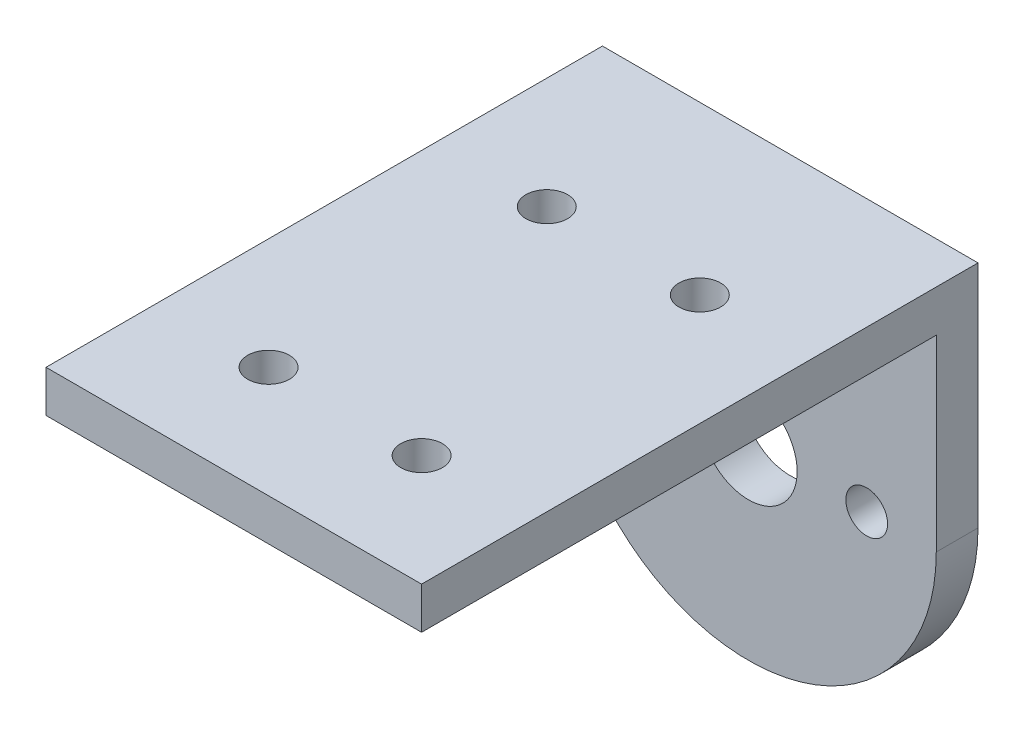
ISO-10303-21;
HEADER;
FILE_DESCRIPTION(('STEP AP214'),'2;1');
FILE_NAME('part.step','',(''),(''),'','','');
FILE_SCHEMA(('AUTOMOTIVE_DESIGN { 1 0 10303 214 1 1 1 1 }'));
ENDSEC;
DATA;
#1=APPLICATION_CONTEXT('core data for automotive mechanical design processes');
#2=APPLICATION_PROTOCOL_DEFINITION('international standard','automotive_design',2000,#1);
#3=PRODUCT_CONTEXT('',#1,'mechanical');
#4=PRODUCT('Part','Part','',(#3));
#5=PRODUCT_RELATED_PRODUCT_CATEGORY('part','',(#4));
#6=PRODUCT_DEFINITION_FORMATION('','',#4);
#7=PRODUCT_DEFINITION_CONTEXT('part definition',#1,'design');
#8=PRODUCT_DEFINITION('design','',#6,#7);
#9=PRODUCT_DEFINITION_SHAPE('','',#8);
#10=(LENGTH_UNIT() NAMED_UNIT(*) SI_UNIT(.MILLI.,.METRE.));
#11=(NAMED_UNIT(*) PLANE_ANGLE_UNIT() SI_UNIT($,.RADIAN.));
#12=(NAMED_UNIT(*) SI_UNIT($,.STERADIAN.) SOLID_ANGLE_UNIT());
#13=UNCERTAINTY_MEASURE_WITH_UNIT(LENGTH_MEASURE(1.E-05),#10,'distance_accuracy_value','');
#14=(GEOMETRIC_REPRESENTATION_CONTEXT(3) GLOBAL_UNCERTAINTY_ASSIGNED_CONTEXT((#13)) GLOBAL_UNIT_ASSIGNED_CONTEXT((#10,
#11,#12)) REPRESENTATION_CONTEXT('',''));
#15=CARTESIAN_POINT('',(0.,0.,0.));
#16=DIRECTION('',(0.,0.,1.));
#17=DIRECTION('',(1.,0.,0.));
#18=AXIS2_PLACEMENT_3D('',#15,#16,#17);
#19=CARTESIAN_POINT('',(2606.26671450499,1592.8264256332,40.));
#20=DIRECTION('',(0.,0.,1.));
#21=DIRECTION('',(1.,0.,0.));
#22=AXIS2_PLACEMENT_3D('',#19,#20,#21);
#23=PLANE('',#22);
#24=DIRECTION('',(1.,0.,0.));
#25=VECTOR('',#24,1.);
#26=CARTESIAN_POINT('',(2579.76671450502,1606.3264256332,40.));
#27=LINE('',#26,#25);
#28=CARTESIAN_POINT('',(2592.76671450499,1606.3264256332,40.));
#29=VERTEX_POINT('',#28);
#30=CARTESIAN_POINT('',(2619.76671450502,1606.3264256332,40.));
#31=VERTEX_POINT('',#30);
#32=EDGE_CURVE('E123',#29,#31,#27,.T.);
#33=ORIENTED_EDGE('',*,*,#32,.T.);
#34=DIRECTION('',(0.,1.,0.));
#35=VECTOR('',#34,1.);
#36=CARTESIAN_POINT('',(2619.76671450499,1592.8264256332,40.));
#37=LINE('',#36,#35);
#38=CARTESIAN_POINT('',(2619.76671450499,1609.3264256332,40.));
#39=VERTEX_POINT('',#38);
#40=EDGE_CURVE('E99',#31,#39,#37,.T.);
#41=ORIENTED_EDGE('',*,*,#40,.T.);
#42=DIRECTION('',(-1.,0.,0.));
#43=VECTOR('',#42,1.);
#44=CARTESIAN_POINT('',(2592.76671450499,1609.3264256332,40.));
#45=LINE('',#44,#43);
#46=CARTESIAN_POINT('',(2592.76671450499,1609.3264256332,40.));
#47=VERTEX_POINT('',#46);
#48=EDGE_CURVE('E59',#39,#47,#45,.T.);
#49=ORIENTED_EDGE('',*,*,#48,.T.);
#50=DIRECTION('',(0.,-1.,0.));
#51=VECTOR('',#50,1.);
#52=CARTESIAN_POINT('',(2592.76671450499,1592.8264256332,40.));
#53=LINE('',#52,#51);
#54=EDGE_CURVE('E90',#47,#29,#53,.T.);
#55=ORIENTED_EDGE('',*,*,#54,.T.);
#56=EDGE_LOOP('',(#33,#41,#49,#55));
#57=FACE_BOUND('',#56,.T.);
#58=ADVANCED_FACE('F33',(#57),#23,.T.);
#59=CARTESIAN_POINT('',(2606.26671450499,1592.8264256332,0.));
#60=DIRECTION('',(0.,0.,1.));
#61=DIRECTION('',(1.,0.,0.));
#62=AXIS2_PLACEMENT_3D('',#59,#60,#61);
#63=PLANE('',#62);
#64=CARTESIAN_POINT('',(2597.76671450499,1592.8264256332,0.));
#65=DIRECTION('',(0.,0.,-1.));
#66=DIRECTION('',(-1.,0.,0.));
#67=AXIS2_PLACEMENT_3D('',#64,#65,#66);
#68=CIRCLE('',#67,1.50000000000011);
#69=CARTESIAN_POINT('',(2596.26671450499,1592.8264256332,0.));
#70=VERTEX_POINT('',#69);
#71=EDGE_CURVE('E336',#70,#70,#68,.T.);
#72=ORIENTED_EDGE('',*,*,#71,.F.);
#73=EDGE_LOOP('',(#72));
#74=FACE_BOUND('',#73,.T.);
#75=CARTESIAN_POINT('',(2614.766714505,1592.8264256332,0.));
#76=DIRECTION('',(0.,0.,-1.));
#77=DIRECTION('',(-1.,0.,0.));
#78=AXIS2_PLACEMENT_3D('',#75,#76,#77);
#79=CIRCLE('',#78,1.49999999999962);
#80=CARTESIAN_POINT('',(2613.266714505,1592.8264256332,0.));
#81=VERTEX_POINT('',#80);
#82=EDGE_CURVE('E341',#81,#81,#79,.T.);
#83=ORIENTED_EDGE('',*,*,#82,.F.);
#84=EDGE_LOOP('',(#83));
#85=FACE_BOUND('',#84,.T.);
#86=CARTESIAN_POINT('',(2606.26671450499,1592.8264256332,0.));
#87=DIRECTION('',(0.,0.,1.));
#88=DIRECTION('',(1.,0.,0.));
#89=AXIS2_PLACEMENT_3D('',#86,#87,#88);
#90=CIRCLE('',#89,13.5000000000001);
#91=CARTESIAN_POINT('',(2592.76671450499,1592.8264256332,0.));
#92=VERTEX_POINT('',#91);
#93=CARTESIAN_POINT('',(2619.76671450499,1592.8264256332,0.));
#94=VERTEX_POINT('',#93);
#95=EDGE_CURVE('E83',#92,#94,#90,.T.);
#96=ORIENTED_EDGE('',*,*,#95,.F.);
#97=DIRECTION('',(0.,-1.,0.));
#98=VECTOR('',#97,1.);
#99=CARTESIAN_POINT('',(2592.76671450499,1592.8264256332,0.));
#100=LINE('',#99,#98);
#101=CARTESIAN_POINT('',(2592.76671450499,1609.3264256332,0.));
#102=VERTEX_POINT('',#101);
#103=EDGE_CURVE('E94',#102,#92,#100,.T.);
#104=ORIENTED_EDGE('',*,*,#103,.F.);
#105=DIRECTION('',(-1.,0.,0.));
#106=VECTOR('',#105,1.);
#107=CARTESIAN_POINT('',(2592.76671450499,1609.3264256332,0.));
#108=LINE('',#107,#106);
#109=CARTESIAN_POINT('',(2619.76671450499,1609.3264256332,0.));
#110=VERTEX_POINT('',#109);
#111=EDGE_CURVE('E100',#110,#102,#108,.T.);
#112=ORIENTED_EDGE('',*,*,#111,.F.);
#113=DIRECTION('',(0.,1.,0.));
#114=VECTOR('',#113,1.);
#115=CARTESIAN_POINT('',(2619.76671450499,1592.8264256332,0.));
#116=LINE('',#115,#114);
#117=EDGE_CURVE('E105',#94,#110,#116,.T.);
#118=ORIENTED_EDGE('',*,*,#117,.F.);
#119=EDGE_LOOP('',(#96,#104,#112,#118));
#120=FACE_BOUND('',#119,.T.);
#121=CARTESIAN_POINT('',(2606.26671450499,1592.8264256332,0.));
#122=DIRECTION('',(0.,0.,1.));
#123=DIRECTION('',(1.,0.,0.));
#124=AXIS2_PLACEMENT_3D('',#121,#122,#123);
#125=CIRCLE('',#124,3.49999999999984);
#126=CARTESIAN_POINT('',(2609.76671450499,1592.8264256332,0.));
#127=VERTEX_POINT('',#126);
#128=EDGE_CURVE('E106',#127,#127,#125,.T.);
#129=ORIENTED_EDGE('',*,*,#128,.T.);
#130=EDGE_LOOP('',(#129));
#131=FACE_BOUND('',#130,.T.);
#132=ADVANCED_FACE('F103',(#74,#85,#120,#131),#63,.F.);
#133=CARTESIAN_POINT('',(2606.26671450499,1592.8264256332,40.));
#134=DIRECTION('',(0.,0.,-1.));
#135=DIRECTION('',(-1.,0.,0.));
#136=AXIS2_PLACEMENT_3D('',#133,#134,#135);
#137=CYLINDRICAL_SURFACE('',#136,13.5000000000001);
#138=DIRECTION('',(0.,0.,-1.));
#139=VECTOR('',#138,1.);
#140=CARTESIAN_POINT('',(2619.76671450499,1592.8264256332,40.));
#141=LINE('',#140,#139);
#142=CARTESIAN_POINT('',(2619.76671450502,1592.8264256332,3.));
#143=VERTEX_POINT('',#142);
#144=EDGE_CURVE('E42',#143,#94,#141,.T.);
#145=ORIENTED_EDGE('',*,*,#144,.F.);
#146=CARTESIAN_POINT('',(2606.26671450499,1592.8264256332,3.));
#147=DIRECTION('',(0.,0.,-1.));
#148=DIRECTION('',(0.,1.,0.));
#149=AXIS2_PLACEMENT_3D('',#146,#147,#148);
#150=CIRCLE('',#149,13.5000000000001);
#151=CARTESIAN_POINT('',(2592.76671450499,1592.8264256332,3.));
#152=VERTEX_POINT('',#151);
#153=EDGE_CURVE('E86',#143,#152,#150,.T.);
#154=ORIENTED_EDGE('',*,*,#153,.T.);
#155=DIRECTION('',(0.,0.,-1.));
#156=VECTOR('',#155,1.);
#157=CARTESIAN_POINT('',(2592.76671450499,1592.8264256332,40.));
#158=LINE('',#157,#156);
#159=EDGE_CURVE('E79',#152,#92,#158,.T.);
#160=ORIENTED_EDGE('',*,*,#159,.T.);
#161=ORIENTED_EDGE('',*,*,#95,.T.);
#162=EDGE_LOOP('',(#145,#154,#160,#161));
#163=FACE_BOUND('',#162,.T.);
#164=ADVANCED_FACE('F35',(#163),#137,.T.);
#165=CARTESIAN_POINT('',(2619.76671450499,1592.8264256332,40.));
#166=DIRECTION('',(-1.,0.,0.));
#167=DIRECTION('',(0.,0.,1.));
#168=AXIS2_PLACEMENT_3D('',#165,#166,#167);
#169=PLANE('',#168);
#170=ORIENTED_EDGE('',*,*,#40,.F.);
#171=DIRECTION('',(0.,0.,1.));
#172=VECTOR('',#171,1.);
#173=CARTESIAN_POINT('',(2619.76671450502,1606.3264256332,40.));
#174=LINE('',#173,#172);
#175=CARTESIAN_POINT('',(2619.76671450502,1606.3264256332,3.));
#176=VERTEX_POINT('',#175);
#177=EDGE_CURVE('E152',#176,#31,#174,.T.);
#178=ORIENTED_EDGE('',*,*,#177,.F.);
#179=DIRECTION('',(0.,1.,0.));
#180=VECTOR('',#179,1.);
#181=CARTESIAN_POINT('',(2619.76671450502,1606.3264256332,3.));
#182=LINE('',#181,#180);
#183=EDGE_CURVE('E128',#143,#176,#182,.T.);
#184=ORIENTED_EDGE('',*,*,#183,.F.);
#185=ORIENTED_EDGE('',*,*,#144,.T.);
#186=ORIENTED_EDGE('',*,*,#117,.T.);
#187=DIRECTION('',(0.,0.,-1.));
#188=VECTOR('',#187,1.);
#189=CARTESIAN_POINT('',(2619.76671450499,1609.3264256332,40.));
#190=LINE('',#189,#188);
#191=EDGE_CURVE('E116',#39,#110,#190,.T.);
#192=ORIENTED_EDGE('',*,*,#191,.F.);
#193=EDGE_LOOP('',(#170,#178,#184,#185,#186,#192));
#194=FACE_BOUND('',#193,.T.);
#195=ADVANCED_FACE('F171',(#194),#169,.F.);
#196=CARTESIAN_POINT('',(2592.76671450499,1609.3264256332,40.));
#197=DIRECTION('',(0.,-1.,0.));
#198=DIRECTION('',(0.,0.,-1.));
#199=AXIS2_PLACEMENT_3D('',#196,#197,#198);
#200=PLANE('',#199);
#201=CARTESIAN_POINT('',(2600.76671450499,1609.3264256332,12.));
#202=DIRECTION('',(0.,1.,0.));
#203=DIRECTION('',(0.,0.,1.));
#204=AXIS2_PLACEMENT_3D('',#201,#202,#203);
#205=CIRCLE('',#204,1.50000000000008);
#206=CARTESIAN_POINT('',(2600.76671450499,1609.3264256332,13.5000000000001));
#207=VERTEX_POINT('',#206);
#208=EDGE_CURVE('E145',#207,#207,#205,.T.);
#209=ORIENTED_EDGE('',*,*,#208,.F.);
#210=EDGE_LOOP('',(#209));
#211=FACE_BOUND('',#210,.T.);
#212=CARTESIAN_POINT('',(2611.76671450499,1609.3264256332,12.));
#213=DIRECTION('',(0.,1.,0.));
#214=DIRECTION('',(0.,0.,1.));
#215=AXIS2_PLACEMENT_3D('',#212,#213,#214);
#216=CIRCLE('',#215,1.50000000000008);
#217=CARTESIAN_POINT('',(2611.76671450499,1609.3264256332,13.5000000000001));
#218=VERTEX_POINT('',#217);
#219=EDGE_CURVE('E135',#218,#218,#216,.T.);
#220=ORIENTED_EDGE('',*,*,#219,.F.);
#221=EDGE_LOOP('',(#220));
#222=FACE_BOUND('',#221,.T.);
#223=CARTESIAN_POINT('',(2611.76671450499,1609.3264256332,32.));
#224=DIRECTION('',(0.,1.,0.));
#225=DIRECTION('',(0.,0.,1.));
#226=AXIS2_PLACEMENT_3D('',#223,#224,#225);
#227=CIRCLE('',#226,1.50000000000008);
#228=CARTESIAN_POINT('',(2611.76671450499,1609.3264256332,33.5000000000001));
#229=VERTEX_POINT('',#228);
#230=EDGE_CURVE('E132',#229,#229,#227,.T.);
#231=ORIENTED_EDGE('',*,*,#230,.F.);
#232=EDGE_LOOP('',(#231));
#233=FACE_BOUND('',#232,.T.);
#234=CARTESIAN_POINT('',(2600.76671450499,1609.3264256332,32.));
#235=DIRECTION('',(0.,1.,0.));
#236=DIRECTION('',(0.,0.,1.));
#237=AXIS2_PLACEMENT_3D('',#234,#235,#236);
#238=CIRCLE('',#237,1.50000000000008);
#239=CARTESIAN_POINT('',(2600.76671450499,1609.3264256332,33.5000000000001));
#240=VERTEX_POINT('',#239);
#241=EDGE_CURVE('E129',#240,#240,#238,.T.);
#242=ORIENTED_EDGE('',*,*,#241,.F.);
#243=EDGE_LOOP('',(#242));
#244=FACE_BOUND('',#243,.T.);
#245=ORIENTED_EDGE('',*,*,#111,.T.);
#246=DIRECTION('',(0.,0.,-1.));
#247=VECTOR('',#246,1.);
#248=CARTESIAN_POINT('',(2592.76671450499,1609.3264256332,40.));
#249=LINE('',#248,#247);
#250=EDGE_CURVE('E89',#47,#102,#249,.T.);
#251=ORIENTED_EDGE('',*,*,#250,.F.);
#252=ORIENTED_EDGE('',*,*,#48,.F.);
#253=ORIENTED_EDGE('',*,*,#191,.T.);
#254=EDGE_LOOP('',(#245,#251,#252,#253));
#255=FACE_BOUND('',#254,.T.);
#256=ADVANCED_FACE('F204',(#211,#222,#233,#244,#255),#200,.F.);
#257=CARTESIAN_POINT('',(2592.76671450499,1592.8264256332,40.));
#258=DIRECTION('',(1.,0.,0.));
#259=DIRECTION('',(0.,0.,-1.));
#260=AXIS2_PLACEMENT_3D('',#257,#258,#259);
#261=PLANE('',#260);
#262=DIRECTION('',(0.,1.,0.));
#263=VECTOR('',#262,1.);
#264=CARTESIAN_POINT('',(2592.76671450499,1592.8264256332,3.));
#265=LINE('',#264,#263);
#266=CARTESIAN_POINT('',(2592.76671450499,1606.3264256332,3.));
#267=VERTEX_POINT('',#266);
#268=EDGE_CURVE('E122',#152,#267,#265,.T.);
#269=ORIENTED_EDGE('',*,*,#268,.T.);
#270=DIRECTION('',(0.,0.,1.));
#271=VECTOR('',#270,1.);
#272=CARTESIAN_POINT('',(2592.76671450499,1606.3264256332,40.));
#273=LINE('',#272,#271);
#274=EDGE_CURVE('E11',#267,#29,#273,.T.);
#275=ORIENTED_EDGE('',*,*,#274,.T.);
#276=ORIENTED_EDGE('',*,*,#54,.F.);
#277=ORIENTED_EDGE('',*,*,#250,.T.);
#278=ORIENTED_EDGE('',*,*,#103,.T.);
#279=ORIENTED_EDGE('',*,*,#159,.F.);
#280=EDGE_LOOP('',(#269,#275,#276,#277,#278,#279));
#281=FACE_BOUND('',#280,.T.);
#282=ADVANCED_FACE('F95',(#281),#261,.F.);
#283=CARTESIAN_POINT('',(2606.26671450499,1592.8264256332,40.));
#284=DIRECTION('',(0.,0.,-1.));
#285=DIRECTION('',(-1.,0.,0.));
#286=AXIS2_PLACEMENT_3D('',#283,#284,#285);
#287=CYLINDRICAL_SURFACE('',#286,3.49999999999984);
#288=CARTESIAN_POINT('',(2606.26671450499,1592.8264256332,3.));
#289=DIRECTION('',(0.,0.,-1.));
#290=DIRECTION('',(0.,1.,0.));
#291=AXIS2_PLACEMENT_3D('',#288,#289,#290);
#292=CIRCLE('',#291,3.49999999999984);
#293=CARTESIAN_POINT('',(2606.26671450499,1596.3264256332,3.));
#294=VERTEX_POINT('',#293);
#295=EDGE_CURVE('E120',#294,#294,#292,.T.);
#296=ORIENTED_EDGE('',*,*,#295,.F.);
#297=EDGE_LOOP('',(#296));
#298=FACE_BOUND('',#297,.T.);
#299=ORIENTED_EDGE('',*,*,#128,.F.);
#300=EDGE_LOOP('',(#299));
#301=FACE_BOUND('',#300,.T.);
#302=ADVANCED_FACE('F188',(#298,#301),#287,.F.);
#303=CARTESIAN_POINT('',(2579.76671450502,1606.3264256332,40.));
#304=DIRECTION('',(0.,1.,0.));
#305=DIRECTION('',(-1.,0.,0.));
#306=AXIS2_PLACEMENT_3D('',#303,#304,#305);
#307=PLANE('',#306);
#308=CARTESIAN_POINT('',(2600.76671450499,1606.3264256332,12.));
#309=DIRECTION('',(0.,1.,0.));
#310=DIRECTION('',(-1.,0.,0.));
#311=AXIS2_PLACEMENT_3D('',#308,#309,#310);
#312=CIRCLE('',#311,1.50000000000008);
#313=CARTESIAN_POINT('',(2599.26671450499,1606.3264256332,12.));
#314=VERTEX_POINT('',#313);
#315=EDGE_CURVE('E37',#314,#314,#312,.T.);
#316=ORIENTED_EDGE('',*,*,#315,.T.);
#317=EDGE_LOOP('',(#316));
#318=FACE_BOUND('',#317,.T.);
#319=CARTESIAN_POINT('',(2611.76671450499,1606.3264256332,12.));
#320=DIRECTION('',(0.,1.,0.));
#321=DIRECTION('',(-1.,0.,0.));
#322=AXIS2_PLACEMENT_3D('',#319,#320,#321);
#323=CIRCLE('',#322,1.50000000000008);
#324=CARTESIAN_POINT('',(2610.26671450499,1606.3264256332,12.));
#325=VERTEX_POINT('',#324);
#326=EDGE_CURVE('E133',#325,#325,#323,.T.);
#327=ORIENTED_EDGE('',*,*,#326,.T.);
#328=EDGE_LOOP('',(#327));
#329=FACE_BOUND('',#328,.T.);
#330=CARTESIAN_POINT('',(2611.76671450499,1606.3264256332,32.));
#331=DIRECTION('',(0.,1.,0.));
#332=DIRECTION('',(-1.,0.,0.));
#333=AXIS2_PLACEMENT_3D('',#330,#331,#332);
#334=CIRCLE('',#333,1.50000000000008);
#335=CARTESIAN_POINT('',(2610.26671450499,1606.3264256332,32.));
#336=VERTEX_POINT('',#335);
#337=EDGE_CURVE('E130',#336,#336,#334,.T.);
#338=ORIENTED_EDGE('',*,*,#337,.T.);
#339=EDGE_LOOP('',(#338));
#340=FACE_BOUND('',#339,.T.);
#341=CARTESIAN_POINT('',(2600.76671450499,1606.3264256332,32.));
#342=DIRECTION('',(0.,1.,0.));
#343=DIRECTION('',(-1.,0.,0.));
#344=AXIS2_PLACEMENT_3D('',#341,#342,#343);
#345=CIRCLE('',#344,1.50000000000008);
#346=CARTESIAN_POINT('',(2599.26671450499,1606.3264256332,32.));
#347=VERTEX_POINT('',#346);
#348=EDGE_CURVE('E125',#347,#347,#345,.T.);
#349=ORIENTED_EDGE('',*,*,#348,.T.);
#350=EDGE_LOOP('',(#349));
#351=FACE_BOUND('',#350,.T.);
#352=DIRECTION('',(1.,0.,0.));
#353=VECTOR('',#352,1.);
#354=CARTESIAN_POINT('',(2579.76671450502,1606.3264256332,3.));
#355=LINE('',#354,#353);
#356=EDGE_CURVE('E50',#267,#176,#355,.T.);
#357=ORIENTED_EDGE('',*,*,#356,.T.);
#358=ORIENTED_EDGE('',*,*,#177,.T.);
#359=ORIENTED_EDGE('',*,*,#32,.F.);
#360=ORIENTED_EDGE('',*,*,#274,.F.);
#361=EDGE_LOOP('',(#357,#358,#359,#360));
#362=FACE_BOUND('',#361,.T.);
#363=ADVANCED_FACE('F164',(#318,#329,#340,#351,#362),#307,.F.);
#364=CARTESIAN_POINT('',(2579.76671450502,1606.3264256332,3.));
#365=DIRECTION('',(0.,0.,-1.));
#366=DIRECTION('',(0.,1.,0.));
#367=AXIS2_PLACEMENT_3D('',#364,#365,#366);
#368=PLANE('',#367);
#369=CARTESIAN_POINT('',(2597.76671450499,1592.8264256332,3.));
#370=DIRECTION('',(0.,0.,-1.));
#371=DIRECTION('',(0.,1.,0.));
#372=AXIS2_PLACEMENT_3D('',#369,#370,#371);
#373=CIRCLE('',#372,1.50000000000011);
#374=CARTESIAN_POINT('',(2597.76671450499,1594.3264256332,3.));
#375=VERTEX_POINT('',#374);
#376=EDGE_CURVE('E334',#375,#375,#373,.F.);
#377=ORIENTED_EDGE('',*,*,#376,.F.);
#378=EDGE_LOOP('',(#377));
#379=FACE_BOUND('',#378,.T.);
#380=CARTESIAN_POINT('',(2614.766714505,1592.8264256332,3.));
#381=DIRECTION('',(0.,0.,-1.));
#382=DIRECTION('',(0.,1.,0.));
#383=AXIS2_PLACEMENT_3D('',#380,#381,#382);
#384=CIRCLE('',#383,1.49999999999962);
#385=CARTESIAN_POINT('',(2614.766714505,1594.3264256332,3.));
#386=VERTEX_POINT('',#385);
#387=EDGE_CURVE('E338',#386,#386,#384,.F.);
#388=ORIENTED_EDGE('',*,*,#387,.F.);
#389=EDGE_LOOP('',(#388));
#390=FACE_BOUND('',#389,.T.);
#391=ORIENTED_EDGE('',*,*,#295,.T.);
#392=EDGE_LOOP('',(#391));
#393=FACE_BOUND('',#392,.T.);
#394=ORIENTED_EDGE('',*,*,#183,.T.);
#395=ORIENTED_EDGE('',*,*,#356,.F.);
#396=ORIENTED_EDGE('',*,*,#268,.F.);
#397=ORIENTED_EDGE('',*,*,#153,.F.);
#398=EDGE_LOOP('',(#394,#395,#396,#397));
#399=FACE_BOUND('',#398,.T.);
#400=ADVANCED_FACE('F176',(#379,#390,#393,#399),#368,.F.);
#401=CARTESIAN_POINT('',(2600.76671450499,1569.3264256332,32.));
#402=DIRECTION('',(0.,1.,0.));
#403=DIRECTION('',(0.,0.,1.));
#404=AXIS2_PLACEMENT_3D('',#401,#402,#403);
#405=CYLINDRICAL_SURFACE('',#404,1.50000000000008);
#406=ORIENTED_EDGE('',*,*,#241,.T.);
#407=EDGE_LOOP('',(#406));
#408=FACE_BOUND('',#407,.T.);
#409=ORIENTED_EDGE('',*,*,#348,.F.);
#410=EDGE_LOOP('',(#409));
#411=FACE_BOUND('',#410,.T.);
#412=ADVANCED_FACE('F178',(#408,#411),#405,.F.);
#413=CARTESIAN_POINT('',(2611.76671450499,1569.3264256332,32.));
#414=DIRECTION('',(0.,1.,0.));
#415=DIRECTION('',(0.,0.,1.));
#416=AXIS2_PLACEMENT_3D('',#413,#414,#415);
#417=CYLINDRICAL_SURFACE('',#416,1.50000000000008);
#418=ORIENTED_EDGE('',*,*,#230,.T.);
#419=EDGE_LOOP('',(#418));
#420=FACE_BOUND('',#419,.T.);
#421=ORIENTED_EDGE('',*,*,#337,.F.);
#422=EDGE_LOOP('',(#421));
#423=FACE_BOUND('',#422,.T.);
#424=ADVANCED_FACE('F185',(#420,#423),#417,.F.);
#425=CARTESIAN_POINT('',(2611.76671450499,1569.3264256332,12.));
#426=DIRECTION('',(0.,1.,0.));
#427=DIRECTION('',(0.,0.,1.));
#428=AXIS2_PLACEMENT_3D('',#425,#426,#427);
#429=CYLINDRICAL_SURFACE('',#428,1.50000000000008);
#430=ORIENTED_EDGE('',*,*,#219,.T.);
#431=EDGE_LOOP('',(#430));
#432=FACE_BOUND('',#431,.T.);
#433=ORIENTED_EDGE('',*,*,#326,.F.);
#434=EDGE_LOOP('',(#433));
#435=FACE_BOUND('',#434,.T.);
#436=ADVANCED_FACE('F258',(#432,#435),#429,.F.);
#437=CARTESIAN_POINT('',(2600.76671450499,1569.3264256332,12.));
#438=DIRECTION('',(0.,1.,0.));
#439=DIRECTION('',(0.,0.,1.));
#440=AXIS2_PLACEMENT_3D('',#437,#438,#439);
#441=CYLINDRICAL_SURFACE('',#440,1.50000000000008);
#442=ORIENTED_EDGE('',*,*,#208,.T.);
#443=EDGE_LOOP('',(#442));
#444=FACE_BOUND('',#443,.T.);
#445=ORIENTED_EDGE('',*,*,#315,.F.);
#446=EDGE_LOOP('',(#445));
#447=FACE_BOUND('',#446,.T.);
#448=ADVANCED_FACE('F223',(#444,#447),#441,.F.);
#449=CARTESIAN_POINT('',(2614.766714505,1592.8264256332,40.001));
#450=DIRECTION('',(0.,0.,-1.));
#451=DIRECTION('',(-1.,0.,0.));
#452=AXIS2_PLACEMENT_3D('',#449,#450,#451);
#453=CYLINDRICAL_SURFACE('',#452,1.49999999999962);
#454=ORIENTED_EDGE('',*,*,#82,.T.);
#455=EDGE_LOOP('',(#454));
#456=FACE_BOUND('',#455,.T.);
#457=ORIENTED_EDGE('',*,*,#387,.T.);
#458=EDGE_LOOP('',(#457));
#459=FACE_BOUND('',#458,.T.);
#460=ADVANCED_FACE('F235',(#456,#459),#453,.F.);
#461=CARTESIAN_POINT('',(2597.76671450499,1592.8264256332,40.001));
#462=DIRECTION('',(0.,0.,-1.));
#463=DIRECTION('',(-1.,0.,0.));
#464=AXIS2_PLACEMENT_3D('',#461,#462,#463);
#465=CYLINDRICAL_SURFACE('',#464,1.50000000000011);
#466=ORIENTED_EDGE('',*,*,#71,.T.);
#467=EDGE_LOOP('',(#466));
#468=FACE_BOUND('',#467,.T.);
#469=ORIENTED_EDGE('',*,*,#376,.T.);
#470=EDGE_LOOP('',(#469));
#471=FACE_BOUND('',#470,.T.);
#472=ADVANCED_FACE('F240',(#468,#471),#465,.F.);
#473=CLOSED_SHELL('',(#58,#132,#164,#195,#256,#282,#302,#363,#400,#412,#424,#436,#448,#460,#472));
#474=MANIFOLD_SOLID_BREP('B2',#473);
#475=ADVANCED_BREP_SHAPE_REPRESENTATION('',(#18,#474),#14);
#476=SHAPE_DEFINITION_REPRESENTATION(#9,#475);
ENDSEC;
END-ISO-10303-21;
